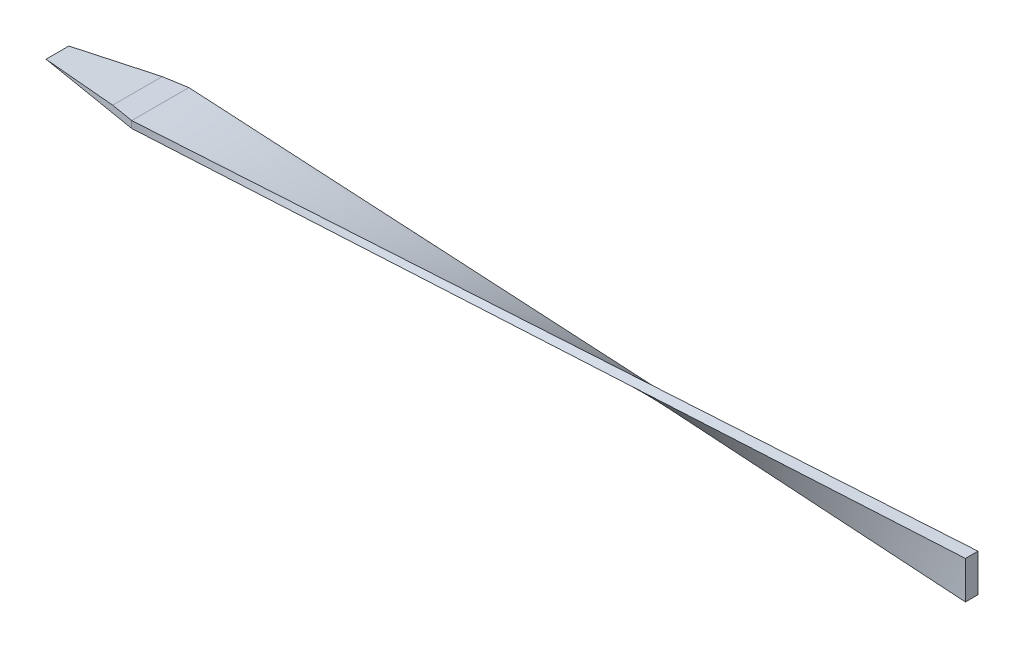
ISO-10303-21;
HEADER;
FILE_DESCRIPTION(('STEP AP214'),'2;1');
FILE_NAME('part.step','',(''),(''),'','','');
FILE_SCHEMA(('AUTOMOTIVE_DESIGN { 1 0 10303 214 1 1 1 1 }'));
ENDSEC;
DATA;
#1=APPLICATION_CONTEXT('core data for automotive mechanical design processes');
#2=APPLICATION_PROTOCOL_DEFINITION('international standard','automotive_design',2000,#1);
#3=PRODUCT_CONTEXT('',#1,'mechanical');
#4=PRODUCT('Part','Part','',(#3));
#5=PRODUCT_RELATED_PRODUCT_CATEGORY('part','',(#4));
#6=PRODUCT_DEFINITION_FORMATION('','',#4);
#7=PRODUCT_DEFINITION_CONTEXT('part definition',#1,'design');
#8=PRODUCT_DEFINITION('design','',#6,#7);
#9=PRODUCT_DEFINITION_SHAPE('','',#8);
#10=(LENGTH_UNIT() NAMED_UNIT(*) SI_UNIT(.MILLI.,.METRE.));
#11=(NAMED_UNIT(*) PLANE_ANGLE_UNIT() SI_UNIT($,.RADIAN.));
#12=(NAMED_UNIT(*) SI_UNIT($,.STERADIAN.) SOLID_ANGLE_UNIT());
#13=UNCERTAINTY_MEASURE_WITH_UNIT(LENGTH_MEASURE(1.E-05),#10,'distance_accuracy_value','');
#14=(GEOMETRIC_REPRESENTATION_CONTEXT(3) GLOBAL_UNCERTAINTY_ASSIGNED_CONTEXT((#13)) GLOBAL_UNIT_ASSIGNED_CONTEXT((#10,
#11,#12)) REPRESENTATION_CONTEXT('',''));
#15=CARTESIAN_POINT('',(0.,0.,0.));
#16=DIRECTION('',(0.,0.,1.));
#17=DIRECTION('',(1.,0.,0.));
#18=AXIS2_PLACEMENT_3D('',#15,#16,#17);
#19=CARTESIAN_POINT('',(0.,0.06,0.));
#20=DIRECTION('',(0.,1.,0.));
#21=DIRECTION('',(0.,0.,1.));
#22=AXIS2_PLACEMENT_3D('',#19,#20,#21);
#23=PLANE('',#22);
#24=DIRECTION('',(0.,0.,1.));
#25=VECTOR('',#24,1.);
#26=CARTESIAN_POINT('',(-7.1,0.06,0.));
#27=LINE('',#26,#25);
#28=CARTESIAN_POINT('',(-7.1,0.06,-0.249999999999999));
#29=VERTEX_POINT('',#28);
#30=CARTESIAN_POINT('',(-7.10000000000001,0.0599999999999999,0.249999999999999));
#31=VERTEX_POINT('',#30);
#32=EDGE_CURVE('E125',#29,#31,#27,.T.);
#33=ORIENTED_EDGE('',*,*,#32,.F.);
#34=DIRECTION('',(0.986393923832144,0.,-0.164398987305357));
#35=VECTOR('',#34,1.);
#36=CARTESIAN_POINT('',(-8.,0.06,-0.0999999999999998));
#37=LINE('',#36,#35);
#38=CARTESIAN_POINT('',(-7.30000000000001,0.0599999999999994,-0.216666666666664));
#39=VERTEX_POINT('',#38);
#40=EDGE_CURVE('E114',#39,#29,#37,.T.);
#41=ORIENTED_EDGE('',*,*,#40,.F.);
#42=DIRECTION('',(0.,0.,1.));
#43=VECTOR('',#42,1.);
#44=CARTESIAN_POINT('',(-7.3,0.06,-1.));
#45=LINE('',#44,#43);
#46=CARTESIAN_POINT('',(-7.3,0.06,0.216666666666666));
#47=VERTEX_POINT('',#46);
#48=EDGE_CURVE('E124',#39,#47,#45,.T.);
#49=ORIENTED_EDGE('',*,*,#48,.T.);
#50=DIRECTION('',(0.986393923832144,0.,0.164398987305357));
#51=VECTOR('',#50,1.);
#52=CARTESIAN_POINT('',(-8.,0.06,0.0999999999999998));
#53=LINE('',#52,#51);
#54=EDGE_CURVE('E71',#47,#31,#53,.T.);
#55=ORIENTED_EDGE('',*,*,#54,.T.);
#56=EDGE_LOOP('',(#33,#41,#49,#55));
#57=FACE_BOUND('',#56,.T.);
#58=ADVANCED_FACE('F51',(#57),#23,.T.);
#59=CARTESIAN_POINT('',(0.,0.,0.));
#60=DIRECTION('',(0.,1.,0.));
#61=DIRECTION('',(0.,0.,1.));
#62=AXIS2_PLACEMENT_3D('',#59,#60,#61);
#63=PLANE('',#62);
#64=DIRECTION('',(0.986393923832144,0.,-0.164398987305357));
#65=VECTOR('',#64,1.);
#66=CARTESIAN_POINT('',(-8.,0.,-0.0999999999999998));
#67=LINE('',#66,#65);
#68=CARTESIAN_POINT('',(-8.,0.,-0.0999999999999998));
#69=VERTEX_POINT('',#68);
#70=CARTESIAN_POINT('',(-7.10000000000001,0.,-0.249999999999999));
#71=VERTEX_POINT('',#70);
#72=EDGE_CURVE('E116',#69,#71,#67,.T.);
#73=ORIENTED_EDGE('',*,*,#72,.T.);
#74=DIRECTION('',(0.,0.,1.));
#75=VECTOR('',#74,1.);
#76=CARTESIAN_POINT('',(-7.1,0.,0.));
#77=LINE('',#76,#75);
#78=CARTESIAN_POINT('',(-7.10000000000003,0.,0.249999999999998));
#79=VERTEX_POINT('',#78);
#80=EDGE_CURVE('E55',#71,#79,#77,.T.);
#81=ORIENTED_EDGE('',*,*,#80,.T.);
#82=DIRECTION('',(0.986393923832144,0.,0.164398987305357));
#83=VECTOR('',#82,1.);
#84=CARTESIAN_POINT('',(-8.,0.,0.0999999999999998));
#85=LINE('',#84,#83);
#86=CARTESIAN_POINT('',(-8.,0.,0.0999999999999998));
#87=VERTEX_POINT('',#86);
#88=EDGE_CURVE('E154',#87,#79,#85,.T.);
#89=ORIENTED_EDGE('',*,*,#88,.F.);
#90=DIRECTION('',(0.,0.,-1.));
#91=VECTOR('',#90,1.);
#92=CARTESIAN_POINT('',(-8.,0.,0.));
#93=LINE('',#92,#91);
#94=EDGE_CURVE('E130',#87,#69,#93,.T.);
#95=ORIENTED_EDGE('',*,*,#94,.T.);
#96=EDGE_LOOP('',(#73,#81,#89,#95));
#97=FACE_BOUND('',#96,.T.);
#98=ADVANCED_FACE('F53',(#97),#63,.F.);
#99=CARTESIAN_POINT('',(-7.3,0.06,-1.));
#100=DIRECTION('',(-0.0854011413464358,0.996346649041751,0.));
#101=DIRECTION('',(-0.996346649041751,-0.0854011413464358,0.));
#102=AXIS2_PLACEMENT_3D('',#99,#100,#101);
#103=PLANE('',#102);
#104=ORIENTED_EDGE('',*,*,#48,.F.);
#105=DIRECTION('',(-0.982887157648091,-0.0842474706555507,0.163814526274681));
#106=VECTOR('',#105,1.);
#107=CARTESIAN_POINT('',(-7.17387456461259,0.0708107516046353,-0.237687572564568));
#108=LINE('',#107,#106);
#109=EDGE_CURVE('E13',#39,#69,#108,.T.);
#110=ORIENTED_EDGE('',*,*,#109,.T.);
#111=ORIENTED_EDGE('',*,*,#94,.F.);
#112=DIRECTION('',(-0.982887157648091,-0.0842474706555507,-0.163814526274681));
#113=VECTOR('',#112,1.);
#114=CARTESIAN_POINT('',(-7.49589695283577,0.043208832614077,0.184017174527372));
#115=LINE('',#114,#113);
#116=EDGE_CURVE('E62',#47,#87,#115,.T.);
#117=ORIENTED_EDGE('',*,*,#116,.F.);
#118=EDGE_LOOP('',(#104,#110,#111,#117));
#119=FACE_BOUND('',#118,.T.);
#120=ADVANCED_FACE('F128',(#119),#103,.T.);
#121=CARTESIAN_POINT('',(-8.,0.06,0.0999999999999998));
#122=DIRECTION('',(0.164398987305357,0.,-0.986393923832144));
#123=DIRECTION('',(-0.986393923832144,0.,-0.164398987305357));
#124=AXIS2_PLACEMENT_3D('',#121,#122,#123);
#125=PLANE('',#124);
#126=ORIENTED_EDGE('',*,*,#116,.T.);
#127=ORIENTED_EDGE('',*,*,#88,.T.);
#128=DIRECTION('',(0.,1.,0.));
#129=VECTOR('',#128,1.);
#130=CARTESIAN_POINT('',(-7.1,0.06,0.249999999999999));
#131=LINE('',#130,#129);
#132=EDGE_CURVE('E151',#31,#79,#131,.F.);
#133=ORIENTED_EDGE('',*,*,#132,.F.);
#134=ORIENTED_EDGE('',*,*,#54,.F.);
#135=EDGE_LOOP('',(#126,#127,#133,#134));
#136=FACE_BOUND('',#135,.T.);
#137=ADVANCED_FACE('F160',(#136),#125,.F.);
#138=CARTESIAN_POINT('',(-8.,0.06,-0.0999999999999998));
#139=DIRECTION('',(-0.164398987305357,0.,-0.986393923832144));
#140=DIRECTION('',(-0.986393923832144,0.,0.164398987305357));
#141=AXIS2_PLACEMENT_3D('',#138,#139,#140);
#142=PLANE('',#141);
#143=ORIENTED_EDGE('',*,*,#40,.T.);
#144=DIRECTION('',(0.,1.,0.));
#145=VECTOR('',#144,1.);
#146=CARTESIAN_POINT('',(-7.1,0.06,-0.249999999999999));
#147=LINE('',#146,#145);
#148=EDGE_CURVE('E146',#29,#71,#147,.F.);
#149=ORIENTED_EDGE('',*,*,#148,.T.);
#150=ORIENTED_EDGE('',*,*,#72,.F.);
#151=ORIENTED_EDGE('',*,*,#109,.F.);
#152=EDGE_LOOP('',(#143,#149,#150,#151));
#153=FACE_BOUND('',#152,.T.);
#154=ADVANCED_FACE('F112',(#153),#142,.T.);
#155=CARTESIAN_POINT('',(0.,0.,0.));
#156=DIRECTION('',(1.,0.,0.));
#157=DIRECTION('',(0.,1.,0.));
#158=AXIS2_PLACEMENT_3D('',#155,#156,#157);
#159=PLANE('',#158);
#160=DIRECTION('',(0.,-1.68870951540177E-05,-0.999999999857413));
#161=VECTOR('',#160,1.);
#162=CARTESIAN_POINT('',(0.,-0.135058858578372,0.0555681977439511));
#163=LINE('',#162,#161);
#164=CARTESIAN_POINT('',(0.,-0.135058858578372,0.0555681977439511));
#165=VERTEX_POINT('',#164);
#166=CARTESIAN_POINT('',(0.,-0.135060716158839,-0.0544318022403643));
#167=VERTEX_POINT('',#166);
#168=EDGE_CURVE('E215',#165,#167,#163,.T.);
#169=ORIENTED_EDGE('',*,*,#168,.T.);
#170=DIRECTION('',(0.,0.999999999857413,-1.68870951550033E-05));
#171=VECTOR('',#170,1.);
#172=CARTESIAN_POINT('',(0.,-0.135060716158839,-0.0544318022403643));
#173=LINE('',#172,#171);
#174=CARTESIAN_POINT('',(0.,0.194939283794107,-0.0544373749817655));
#175=VERTEX_POINT('',#174);
#176=EDGE_CURVE('E208',#167,#175,#173,.T.);
#177=ORIENTED_EDGE('',*,*,#176,.T.);
#178=DIRECTION('',(0.,-1.68870951550033E-05,-0.999999999857413));
#179=VECTOR('',#178,1.);
#180=CARTESIAN_POINT('',(0.,0.194941141374574,0.05556262500255));
#181=LINE('',#180,#179);
#182=CARTESIAN_POINT('',(0.,0.194941141374574,0.05556262500255));
#183=VERTEX_POINT('',#182);
#184=EDGE_CURVE('E99',#183,#175,#181,.T.);
#185=ORIENTED_EDGE('',*,*,#184,.F.);
#186=DIRECTION('',(0.,0.999999999857413,-1.68870951550033E-05));
#187=VECTOR('',#186,1.);
#188=CARTESIAN_POINT('',(0.,-0.135058858578372,0.0555681977439511));
#189=LINE('',#188,#187);
#190=EDGE_CURVE('E219',#165,#183,#189,.T.);
#191=ORIENTED_EDGE('',*,*,#190,.F.);
#192=EDGE_LOOP('',(#169,#177,#185,#191));
#193=FACE_BOUND('',#192,.T.);
#194=ADVANCED_FACE('F174',(#193),#159,.T.);
#195=CARTESIAN_POINT('',(-7.1,0.06,0.249999999999999));
#196=CARTESIAN_POINT('',(0.,0.194939283794107,-0.0544373749817655));
#197=CARTESIAN_POINT('',(-7.1,0.05,0.249999999999999));
#198=CARTESIAN_POINT('',(0.,0.194939593390852,-0.0361040416510462));
#199=CARTESIAN_POINT('',(-7.1,0.04,0.249999999999999));
#200=CARTESIAN_POINT('',(0.,0.194939902987596,-0.017770708320327));
#201=CARTESIAN_POINT('',(-7.1,0.02,0.249999999999999));
#202=CARTESIAN_POINT('',(0.,0.194940522181085,0.0188959583411115));
#203=CARTESIAN_POINT('',(-7.1,0.00999999999999998,0.249999999999999));
#204=CARTESIAN_POINT('',(0.,0.19494083177783,0.0372292916718307));
#205=CARTESIAN_POINT('',(-7.1,0.,0.249999999999999));
#206=CARTESIAN_POINT('',(0.,0.194941141374574,0.05556262500255));
#207=B_SPLINE_SURFACE_WITH_KNOTS('',3,1,((#195,#196),(#197,#198),(#199,#200),(#201,#202),(#203,
#204),(#205,#206)),.UNSPECIFIED.,.F.,.F.,.F.,(4,2,4),(2,2),(0.,0.5,1.),(0.,1.),.UNSPECIFIED.);
#208=DIRECTION('',(0.999248933278534,0.0274358771226258,-0.0273649774022084));
#209=VECTOR('',#208,1.);
#210=CARTESIAN_POINT('',(-3.55,0.0974705706872871,0.152781312501275));
#211=LINE('',#210,#209);
#212=EDGE_CURVE('E243',#79,#183,#211,.T.);
#213=DIRECTION('',(-0.998901923137946,-0.0189846633927874,0.0428314196259652));
#214=VECTOR('',#213,1.);
#215=CARTESIAN_POINT('',(-3.55,0.127469641897054,0.0977813125091169));
#216=LINE('',#215,#214);
#217=EDGE_CURVE('E230',#175,#31,#216,.T.);
#218=ORIENTED_EDGE('',*,*,#132,.T.);
#219=ORIENTED_EDGE('',*,*,#212,.T.);
#220=ORIENTED_EDGE('',*,*,#184,.T.);
#221=ORIENTED_EDGE('',*,*,#217,.T.);
#222=EDGE_LOOP('',(#218,#219,#220,#221));
#223=FACE_BOUND('',#222,.T.);
#224=ADVANCED_FACE('F183',(#223),#207,.T.);
#225=CARTESIAN_POINT('',(-7.1,0.,0.249999999999999));
#226=CARTESIAN_POINT('',(0.,0.194941141374574,0.05556262500255));
#227=CARTESIAN_POINT('',(-7.1,0.,0.166666666666666));
#228=CARTESIAN_POINT('',(0.,0.139941141382417,0.0555635537927835));
#229=CARTESIAN_POINT('',(-7.1,0.,0.083333333333333));
#230=CARTESIAN_POINT('',(0.,0.0849411413902589,0.055564482583017));
#231=CARTESIAN_POINT('',(-7.1,0.,-0.0833333333333332));
#232=CARTESIAN_POINT('',(0.,-0.0250588585940566,0.0555663401634841));
#233=CARTESIAN_POINT('',(-7.1,0.,-0.166666666666666));
#234=CARTESIAN_POINT('',(0.,-0.0800588585862144,0.0555672689537176));
#235=CARTESIAN_POINT('',(-7.1,0.,-0.249999999999999));
#236=CARTESIAN_POINT('',(0.,-0.135058858578372,0.0555681977439511));
#237=B_SPLINE_SURFACE_WITH_KNOTS('',3,1,((#225,#226),(#227,#228),(#229,#230),(#231,#232),(#233,
#234),(#235,#236)),.UNSPECIFIED.,.F.,.F.,.F.,(4,2,4),(2,2),(0.,0.5,1.),(0.,1.),.UNSPECIFIED.);
#238=DIRECTION('',(0.998894784581003,-0.0190013506261126,0.0429902083183449));
#239=VECTOR('',#238,1.);
#240=CARTESIAN_POINT('',(-3.55,-0.0675294292891862,-0.0972159011280241));
#241=LINE('',#240,#239);
#242=EDGE_CURVE('E236',#71,#165,#241,.T.);
#243=ORIENTED_EDGE('',*,*,#80,.F.);
#244=ORIENTED_EDGE('',*,*,#242,.T.);
#245=ORIENTED_EDGE('',*,*,#190,.T.);
#246=ORIENTED_EDGE('',*,*,#212,.F.);
#247=EDGE_LOOP('',(#243,#244,#245,#246));
#248=FACE_BOUND('',#247,.T.);
#249=ADVANCED_FACE('F241',(#248),#237,.T.);
#250=CARTESIAN_POINT('',(-7.1,0.06,-0.249999999999999));
#251=CARTESIAN_POINT('',(0.,-0.135060716158839,-0.0544318022403643));
#252=CARTESIAN_POINT('',(-7.1,0.06,-0.166666666666666));
#253=CARTESIAN_POINT('',(0.,-0.0800607161666812,-0.0544327310305979));
#254=CARTESIAN_POINT('',(-7.1,0.06,-0.083333333333333));
#255=CARTESIAN_POINT('',(0.,-0.0250607161745233,-0.0544336598208314));
#256=CARTESIAN_POINT('',(-7.1,0.06,0.0833333333333332));
#257=CARTESIAN_POINT('',(0.,0.0849392838097921,-0.0544355174012984));
#258=CARTESIAN_POINT('',(-7.1,0.06,0.166666666666666));
#259=CARTESIAN_POINT('',(0.,0.13993928380195,-0.054436446191532));
#260=CARTESIAN_POINT('',(-7.1,0.06,0.249999999999999));
#261=CARTESIAN_POINT('',(0.,0.194939283794107,-0.0544373749817655));
#262=B_SPLINE_SURFACE_WITH_KNOTS('',3,1,((#250,#251),(#252,#253),(#254,#255),(#256,#257),(#258,
#259),(#260,#261)),.UNSPECIFIED.,.F.,.F.,.F.,(4,2,4),(2,2),(0.,0.5,1.),(0.,1.),.UNSPECIFIED.);
#263=DIRECTION('',(0.999244107251277,-0.0274525734053428,0.0275239956587419));
#264=VECTOR('',#263,1.);
#265=CARTESIAN_POINT('',(-3.55,-0.0375303580794196,-0.152215901120182));
#266=LINE('',#265,#264);
#267=EDGE_CURVE('E150',#29,#167,#266,.T.);
#268=ORIENTED_EDGE('',*,*,#32,.T.);
#269=ORIENTED_EDGE('',*,*,#217,.F.);
#270=ORIENTED_EDGE('',*,*,#176,.F.);
#271=ORIENTED_EDGE('',*,*,#267,.F.);
#272=EDGE_LOOP('',(#268,#269,#270,#271));
#273=FACE_BOUND('',#272,.T.);
#274=ADVANCED_FACE('F271',(#273),#262,.T.);
#275=CARTESIAN_POINT('',(-7.1,0.,-0.249999999999999));
#276=CARTESIAN_POINT('',(0.,-0.135058858578372,0.0555681977439511));
#277=CARTESIAN_POINT('',(-7.1,0.01,-0.249999999999999));
#278=CARTESIAN_POINT('',(0.,-0.135059168175117,0.0372348644132319));
#279=CARTESIAN_POINT('',(-7.1,0.02,-0.249999999999999));
#280=CARTESIAN_POINT('',(0.,-0.135059477771861,0.0189015310825127));
#281=CARTESIAN_POINT('',(-7.1,0.04,-0.249999999999999));
#282=CARTESIAN_POINT('',(0.,-0.13506009696535,-0.0177651355789258));
#283=CARTESIAN_POINT('',(-7.1,0.05,-0.249999999999999));
#284=CARTESIAN_POINT('',(0.,-0.135060406562095,-0.0360984689096451));
#285=CARTESIAN_POINT('',(-7.1,0.06,-0.249999999999999));
#286=CARTESIAN_POINT('',(0.,-0.135060716158839,-0.0544318022403643));
#287=B_SPLINE_SURFACE_WITH_KNOTS('',3,1,((#275,#276),(#277,#278),(#279,#280),(#281,#282),(#283,
#284),(#285,#286)),.UNSPECIFIED.,.F.,.F.,.F.,(4,2,4),(2,2),(0.,0.5,1.),(0.,1.),.UNSPECIFIED.);
#288=ORIENTED_EDGE('',*,*,#148,.F.);
#289=ORIENTED_EDGE('',*,*,#267,.T.);
#290=ORIENTED_EDGE('',*,*,#168,.F.);
#291=ORIENTED_EDGE('',*,*,#242,.F.);
#292=EDGE_LOOP('',(#288,#289,#290,#291));
#293=FACE_BOUND('',#292,.T.);
#294=ADVANCED_FACE('F235',(#293),#287,.T.);
#295=CLOSED_SHELL('',(#58,#98,#120,#137,#154,#194,#224,#249,#274,#294));
#296=MANIFOLD_SOLID_BREP('B2',#295);
#297=ADVANCED_BREP_SHAPE_REPRESENTATION('',(#18,#296),#14);
#298=SHAPE_DEFINITION_REPRESENTATION(#9,#297);
ENDSEC;
END-ISO-10303-21;
